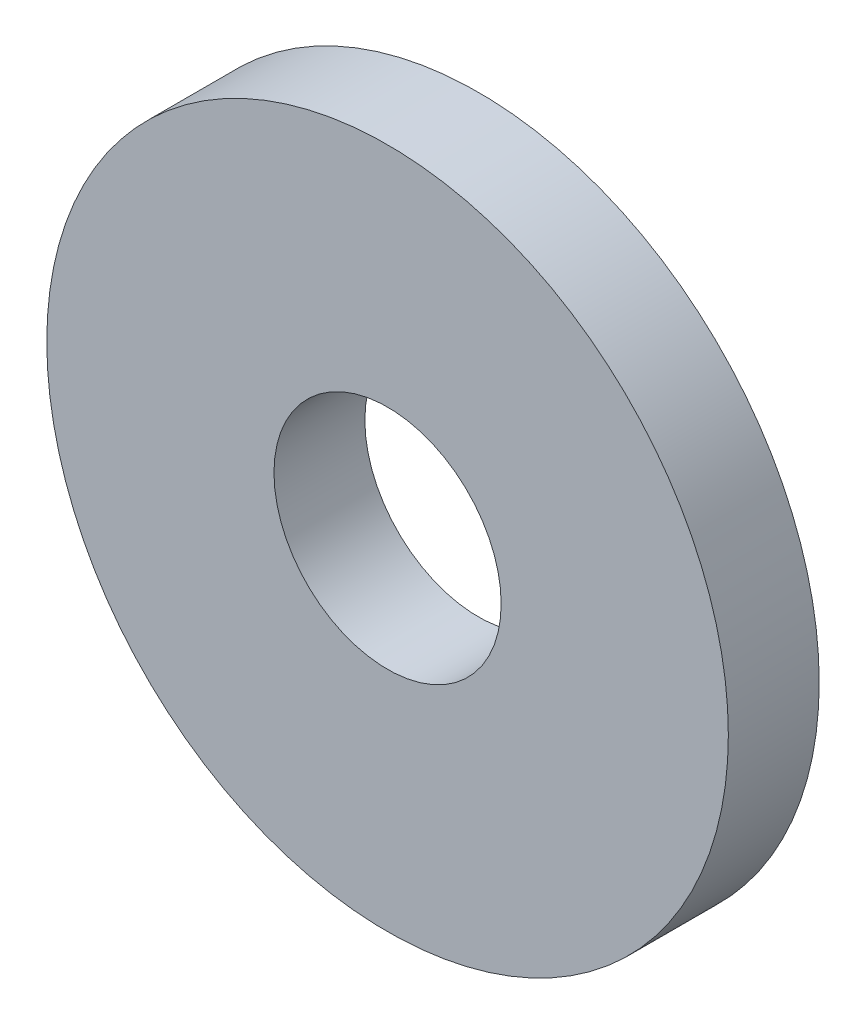
ISO-10303-21;
HEADER;
FILE_DESCRIPTION(('STEP AP214'),'2;1');
FILE_NAME('part.step','',(''),(''),'','','');
FILE_SCHEMA(('AUTOMOTIVE_DESIGN { 1 0 10303 214 1 1 1 1 }'));
ENDSEC;
DATA;
#1=APPLICATION_CONTEXT('core data for automotive mechanical design processes');
#2=APPLICATION_PROTOCOL_DEFINITION('international standard','automotive_design',2000,#1);
#3=PRODUCT_CONTEXT('',#1,'mechanical');
#4=PRODUCT('Part','Part','',(#3));
#5=PRODUCT_RELATED_PRODUCT_CATEGORY('part','',(#4));
#6=PRODUCT_DEFINITION_FORMATION('','',#4);
#7=PRODUCT_DEFINITION_CONTEXT('part definition',#1,'design');
#8=PRODUCT_DEFINITION('design','',#6,#7);
#9=PRODUCT_DEFINITION_SHAPE('','',#8);
#10=(LENGTH_UNIT() NAMED_UNIT(*) SI_UNIT(.MILLI.,.METRE.));
#11=(NAMED_UNIT(*) PLANE_ANGLE_UNIT() SI_UNIT($,.RADIAN.));
#12=(NAMED_UNIT(*) SI_UNIT($,.STERADIAN.) SOLID_ANGLE_UNIT());
#13=UNCERTAINTY_MEASURE_WITH_UNIT(LENGTH_MEASURE(1.E-05),#10,'distance_accuracy_value','');
#14=(GEOMETRIC_REPRESENTATION_CONTEXT(3) GLOBAL_UNCERTAINTY_ASSIGNED_CONTEXT((#13)) GLOBAL_UNIT_ASSIGNED_CONTEXT((#10,
#11,#12)) REPRESENTATION_CONTEXT('',''));
#15=CARTESIAN_POINT('',(0.,0.,0.));
#16=DIRECTION('',(0.,0.,1.));
#17=DIRECTION('',(1.,0.,0.));
#18=AXIS2_PLACEMENT_3D('',#15,#16,#17);
#19=CARTESIAN_POINT('',(0.,0.,2.));
#20=DIRECTION('',(0.,0.,1.));
#21=DIRECTION('',(1.,0.,0.));
#22=AXIS2_PLACEMENT_3D('',#19,#20,#21);
#23=PLANE('',#22);
#24=CARTESIAN_POINT('',(0.,0.,2.));
#25=DIRECTION('',(0.,0.,1.));
#26=DIRECTION('',(1.,0.,0.));
#27=AXIS2_PLACEMENT_3D('',#24,#25,#26);
#28=CIRCLE('',#27,7.5);
#29=CARTESIAN_POINT('',(7.5,0.,2.));
#30=VERTEX_POINT('',#29);
#31=EDGE_CURVE('E10',#30,#30,#28,.T.);
#32=ORIENTED_EDGE('',*,*,#31,.T.);
#33=EDGE_LOOP('',(#32));
#34=FACE_BOUND('',#33,.T.);
#35=CARTESIAN_POINT('',(0.,0.,2.));
#36=DIRECTION('',(0.,0.,1.));
#37=DIRECTION('',(1.,0.,0.));
#38=AXIS2_PLACEMENT_3D('',#35,#36,#37);
#39=CIRCLE('',#38,2.5);
#40=CARTESIAN_POINT('',(2.5,0.,2.));
#41=VERTEX_POINT('',#40);
#42=EDGE_CURVE('E44',#41,#41,#39,.T.);
#43=ORIENTED_EDGE('',*,*,#42,.F.);
#44=EDGE_LOOP('',(#43));
#45=FACE_BOUND('',#44,.T.);
#46=ADVANCED_FACE('F33',(#34,#45),#23,.T.);
#47=CARTESIAN_POINT('',(0.,0.,0.));
#48=DIRECTION('',(0.,0.,1.));
#49=DIRECTION('',(1.,0.,0.));
#50=AXIS2_PLACEMENT_3D('',#47,#48,#49);
#51=PLANE('',#50);
#52=CARTESIAN_POINT('',(0.,0.,0.));
#53=DIRECTION('',(0.,0.,1.));
#54=DIRECTION('',(1.,0.,0.));
#55=AXIS2_PLACEMENT_3D('',#52,#53,#54);
#56=CIRCLE('',#55,7.5);
#57=CARTESIAN_POINT('',(7.5,0.,0.));
#58=VERTEX_POINT('',#57);
#59=EDGE_CURVE('E37',#58,#58,#56,.T.);
#60=ORIENTED_EDGE('',*,*,#59,.F.);
#61=EDGE_LOOP('',(#60));
#62=FACE_BOUND('',#61,.T.);
#63=CARTESIAN_POINT('',(0.,0.,0.));
#64=DIRECTION('',(0.,0.,1.));
#65=DIRECTION('',(1.,0.,0.));
#66=AXIS2_PLACEMENT_3D('',#63,#64,#65);
#67=CIRCLE('',#66,2.5);
#68=CARTESIAN_POINT('',(2.5,0.,0.));
#69=VERTEX_POINT('',#68);
#70=EDGE_CURVE('E46',#69,#69,#67,.T.);
#71=ORIENTED_EDGE('',*,*,#70,.T.);
#72=EDGE_LOOP('',(#71));
#73=FACE_BOUND('',#72,.T.);
#74=ADVANCED_FACE('F56',(#62,#73),#51,.F.);
#75=CARTESIAN_POINT('',(0.,0.,2.));
#76=DIRECTION('',(0.,0.,-1.));
#77=DIRECTION('',(-1.,0.,0.));
#78=AXIS2_PLACEMENT_3D('',#75,#76,#77);
#79=CYLINDRICAL_SURFACE('',#78,7.5);
#80=ORIENTED_EDGE('',*,*,#31,.F.);
#81=EDGE_LOOP('',(#80));
#82=FACE_BOUND('',#81,.T.);
#83=ORIENTED_EDGE('',*,*,#59,.T.);
#84=EDGE_LOOP('',(#83));
#85=FACE_BOUND('',#84,.T.);
#86=ADVANCED_FACE('F35',(#82,#85),#79,.T.);
#87=CARTESIAN_POINT('',(0.,0.,2.));
#88=DIRECTION('',(0.,0.,-1.));
#89=DIRECTION('',(-1.,0.,0.));
#90=AXIS2_PLACEMENT_3D('',#87,#88,#89);
#91=CYLINDRICAL_SURFACE('',#90,2.5);
#92=ORIENTED_EDGE('',*,*,#42,.T.);
#93=EDGE_LOOP('',(#92));
#94=FACE_BOUND('',#93,.T.);
#95=ORIENTED_EDGE('',*,*,#70,.F.);
#96=EDGE_LOOP('',(#95));
#97=FACE_BOUND('',#96,.T.);
#98=ADVANCED_FACE('F52',(#94,#97),#91,.F.);
#99=CLOSED_SHELL('',(#46,#74,#86,#98));
#100=MANIFOLD_SOLID_BREP('B2',#99);
#101=ADVANCED_BREP_SHAPE_REPRESENTATION('',(#18,#100),#14);
#102=SHAPE_DEFINITION_REPRESENTATION(#9,#101);
ENDSEC;
END-ISO-10303-21;
